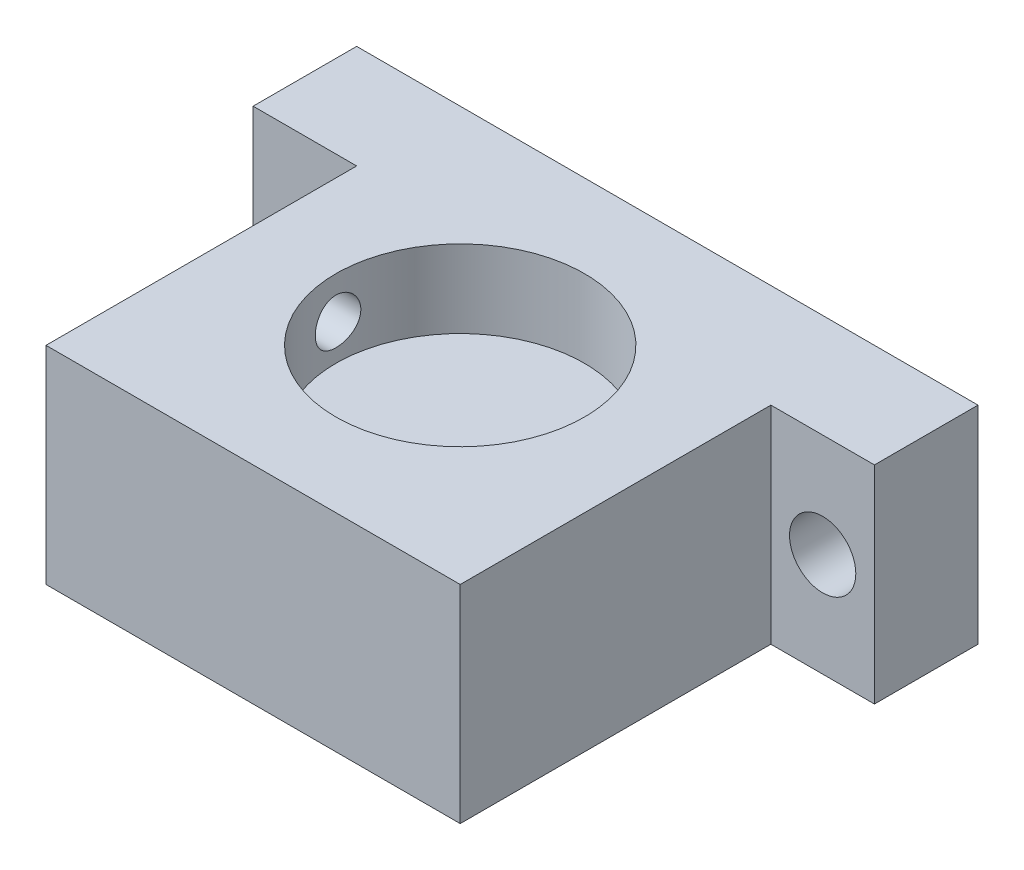
ISO-10303-21;
HEADER;
FILE_DESCRIPTION(('STEP AP214'),'2;1');
FILE_NAME('part.step','',(''),(''),'','','');
FILE_SCHEMA(('AUTOMOTIVE_DESIGN { 1 0 10303 214 1 1 1 1 }'));
ENDSEC;
DATA;
#1=APPLICATION_CONTEXT('core data for automotive mechanical design processes');
#2=APPLICATION_PROTOCOL_DEFINITION('international standard','automotive_design',2000,#1);
#3=PRODUCT_CONTEXT('',#1,'mechanical');
#4=PRODUCT('Part','Part','',(#3));
#5=PRODUCT_RELATED_PRODUCT_CATEGORY('part','',(#4));
#6=PRODUCT_DEFINITION_FORMATION('','',#4);
#7=PRODUCT_DEFINITION_CONTEXT('part definition',#1,'design');
#8=PRODUCT_DEFINITION('design','',#6,#7);
#9=PRODUCT_DEFINITION_SHAPE('','',#8);
#10=(LENGTH_UNIT() NAMED_UNIT(*) SI_UNIT(.MILLI.,.METRE.));
#11=(NAMED_UNIT(*) PLANE_ANGLE_UNIT() SI_UNIT($,.RADIAN.));
#12=(NAMED_UNIT(*) SI_UNIT($,.STERADIAN.) SOLID_ANGLE_UNIT());
#13=UNCERTAINTY_MEASURE_WITH_UNIT(LENGTH_MEASURE(1.E-05),#10,'distance_accuracy_value','');
#14=(GEOMETRIC_REPRESENTATION_CONTEXT(3) GLOBAL_UNCERTAINTY_ASSIGNED_CONTEXT((#13)) GLOBAL_UNIT_ASSIGNED_CONTEXT((#10,
#11,#12)) REPRESENTATION_CONTEXT('',''));
#15=CARTESIAN_POINT('',(0.,0.,0.));
#16=DIRECTION('',(0.,0.,1.));
#17=DIRECTION('',(1.,0.,0.));
#18=AXIS2_PLACEMENT_3D('',#15,#16,#17);
#19=CARTESIAN_POINT('',(0.,10.,0.));
#20=DIRECTION('',(-1.,0.,0.));
#21=DIRECTION('',(0.,0.,1.));
#22=AXIS2_PLACEMENT_3D('',#19,#20,#21);
#23=PLANE('',#22);
#24=CARTESIAN_POINT('',(0.,8.,-10.));
#25=DIRECTION('',(-1.,0.,0.));
#26=DIRECTION('',(0.,0.,1.));
#27=AXIS2_PLACEMENT_3D('',#24,#25,#26);
#28=CIRCLE('',#27,1.1);
#29=CARTESIAN_POINT('',(0.,8.,-8.9));
#30=VERTEX_POINT('',#29);
#31=EDGE_CURVE('E191',#30,#30,#28,.T.);
#32=ORIENTED_EDGE('',*,*,#31,.F.);
#33=EDGE_LOOP('',(#32));
#34=FACE_BOUND('',#33,.T.);
#35=DIRECTION('',(0.,0.,-1.));
#36=VECTOR('',#35,1.);
#37=CARTESIAN_POINT('',(0.,10.,0.));
#38=LINE('',#37,#36);
#39=CARTESIAN_POINT('',(0.,10.,0.));
#40=VERTEX_POINT('',#39);
#41=CARTESIAN_POINT('',(0.,10.,-15.));
#42=VERTEX_POINT('',#41);
#43=EDGE_CURVE('E266',#40,#42,#38,.T.);
#44=ORIENTED_EDGE('',*,*,#43,.T.);
#45=DIRECTION('',(0.,-1.,0.));
#46=VECTOR('',#45,1.);
#47=CARTESIAN_POINT('',(0.,10.,-15.));
#48=LINE('',#47,#46);
#49=CARTESIAN_POINT('',(0.,0.,-15.));
#50=VERTEX_POINT('',#49);
#51=EDGE_CURVE('E131',#42,#50,#48,.T.);
#52=ORIENTED_EDGE('',*,*,#51,.T.);
#53=DIRECTION('',(0.,0.,-1.));
#54=VECTOR('',#53,1.);
#55=CARTESIAN_POINT('',(0.,0.,0.));
#56=LINE('',#55,#54);
#57=CARTESIAN_POINT('',(0.,0.,0.));
#58=VERTEX_POINT('',#57);
#59=EDGE_CURVE('E120',#58,#50,#56,.T.);
#60=ORIENTED_EDGE('',*,*,#59,.F.);
#61=DIRECTION('',(0.,-1.,0.));
#62=VECTOR('',#61,1.);
#63=CARTESIAN_POINT('',(0.,10.,0.));
#64=LINE('',#63,#62);
#65=EDGE_CURVE('E50',#40,#58,#64,.T.);
#66=ORIENTED_EDGE('',*,*,#65,.F.);
#67=EDGE_LOOP('',(#44,#52,#60,#66));
#68=FACE_BOUND('',#67,.T.);
#69=ADVANCED_FACE('F41',(#34,#68),#23,.T.);
#70=CARTESIAN_POINT('',(20.,10.,0.));
#71=DIRECTION('',(-1.,0.,0.));
#72=DIRECTION('',(0.,0.,1.));
#73=AXIS2_PLACEMENT_3D('',#70,#71,#72);
#74=PLANE('',#73);
#75=DIRECTION('',(0.,-1.,0.));
#76=VECTOR('',#75,1.);
#77=CARTESIAN_POINT('',(20.,10.,-15.));
#78=LINE('',#77,#76);
#79=CARTESIAN_POINT('',(20.,10.,-15.));
#80=VERTEX_POINT('',#79);
#81=CARTESIAN_POINT('',(20.,0.,-15.));
#82=VERTEX_POINT('',#81);
#83=EDGE_CURVE('E65',#80,#82,#78,.T.);
#84=ORIENTED_EDGE('',*,*,#83,.F.);
#85=DIRECTION('',(0.,0.,-1.));
#86=VECTOR('',#85,1.);
#87=CARTESIAN_POINT('',(20.,10.,0.));
#88=LINE('',#87,#86);
#89=CARTESIAN_POINT('',(20.,10.,0.));
#90=VERTEX_POINT('',#89);
#91=EDGE_CURVE('E256',#90,#80,#88,.T.);
#92=ORIENTED_EDGE('',*,*,#91,.F.);
#93=DIRECTION('',(0.,-1.,0.));
#94=VECTOR('',#93,1.);
#95=CARTESIAN_POINT('',(20.,10.,0.));
#96=LINE('',#95,#94);
#97=CARTESIAN_POINT('',(20.,0.,0.));
#98=VERTEX_POINT('',#97);
#99=EDGE_CURVE('E11',#90,#98,#96,.T.);
#100=ORIENTED_EDGE('',*,*,#99,.T.);
#101=DIRECTION('',(0.,0.,-1.));
#102=VECTOR('',#101,1.);
#103=CARTESIAN_POINT('',(20.,0.,0.));
#104=LINE('',#103,#102);
#105=EDGE_CURVE('E121',#98,#82,#104,.T.);
#106=ORIENTED_EDGE('',*,*,#105,.T.);
#107=EDGE_LOOP('',(#84,#92,#100,#106));
#108=FACE_BOUND('',#107,.T.);
#109=ADVANCED_FACE('F224',(#108),#74,.F.);
#110=CARTESIAN_POINT('',(0.,10.,0.));
#111=DIRECTION('',(0.,0.,-1.));
#112=DIRECTION('',(-1.,0.,0.));
#113=AXIS2_PLACEMENT_3D('',#110,#111,#112);
#114=PLANE('',#113);
#115=DIRECTION('',(1.,0.,0.));
#116=VECTOR('',#115,1.);
#117=CARTESIAN_POINT('',(0.,0.,0.));
#118=LINE('',#117,#116);
#119=EDGE_CURVE('E274',#58,#98,#118,.T.);
#120=ORIENTED_EDGE('',*,*,#119,.T.);
#121=ORIENTED_EDGE('',*,*,#99,.F.);
#122=DIRECTION('',(1.,0.,0.));
#123=VECTOR('',#122,1.);
#124=CARTESIAN_POINT('',(0.,10.,0.));
#125=LINE('',#124,#123);
#126=EDGE_CURVE('E259',#40,#90,#125,.T.);
#127=ORIENTED_EDGE('',*,*,#126,.F.);
#128=ORIENTED_EDGE('',*,*,#65,.T.);
#129=EDGE_LOOP('',(#120,#121,#127,#128));
#130=FACE_BOUND('',#129,.T.);
#131=ADVANCED_FACE('F43',(#130),#114,.F.);
#132=CARTESIAN_POINT('',(0.,10.,-20.));
#133=DIRECTION('',(0.,0.,-1.));
#134=DIRECTION('',(-1.,0.,0.));
#135=AXIS2_PLACEMENT_3D('',#132,#133,#134);
#136=PLANE('',#135);
#137=CARTESIAN_POINT('',(-2.5,5.,-20.));
#138=DIRECTION('',(0.,0.,-1.));
#139=DIRECTION('',(-1.,0.,0.));
#140=AXIS2_PLACEMENT_3D('',#137,#138,#139);
#141=CIRCLE('',#140,1.6);
#142=CARTESIAN_POINT('',(-4.1,5.,-20.));
#143=VERTEX_POINT('',#142);
#144=EDGE_CURVE('E148',#143,#143,#141,.T.);
#145=ORIENTED_EDGE('',*,*,#144,.F.);
#146=EDGE_LOOP('',(#145));
#147=FACE_BOUND('',#146,.T.);
#148=CARTESIAN_POINT('',(22.5,5.,-20.));
#149=DIRECTION('',(0.,0.,1.));
#150=DIRECTION('',(1.,0.,0.));
#151=AXIS2_PLACEMENT_3D('',#148,#149,#150);
#152=CIRCLE('',#151,1.6);
#153=CARTESIAN_POINT('',(24.1,5.,-20.));
#154=VERTEX_POINT('',#153);
#155=EDGE_CURVE('E154',#154,#154,#152,.T.);
#156=ORIENTED_EDGE('',*,*,#155,.T.);
#157=EDGE_LOOP('',(#156));
#158=FACE_BOUND('',#157,.T.);
#159=DIRECTION('',(1.,0.,0.));
#160=VECTOR('',#159,1.);
#161=CARTESIAN_POINT('',(0.,0.,-20.));
#162=LINE('',#161,#160);
#163=CARTESIAN_POINT('',(-5.,0.,-20.));
#164=VERTEX_POINT('',#163);
#165=CARTESIAN_POINT('',(25.,0.,-20.));
#166=VERTEX_POINT('',#165);
#167=EDGE_CURVE('E108',#164,#166,#162,.T.);
#168=ORIENTED_EDGE('',*,*,#167,.F.);
#169=DIRECTION('',(0.,1.,0.));
#170=VECTOR('',#169,1.);
#171=CARTESIAN_POINT('',(-5.,10.,-20.));
#172=LINE('',#171,#170);
#173=CARTESIAN_POINT('',(-5.,10.,-20.));
#174=VERTEX_POINT('',#173);
#175=EDGE_CURVE('E111',#164,#174,#172,.T.);
#176=ORIENTED_EDGE('',*,*,#175,.T.);
#177=DIRECTION('',(1.,0.,0.));
#178=VECTOR('',#177,1.);
#179=CARTESIAN_POINT('',(0.,10.,-20.));
#180=LINE('',#179,#178);
#181=CARTESIAN_POINT('',(25.,10.,-20.));
#182=VERTEX_POINT('',#181);
#183=EDGE_CURVE('E262',#174,#182,#180,.T.);
#184=ORIENTED_EDGE('',*,*,#183,.T.);
#185=DIRECTION('',(0.,1.,0.));
#186=VECTOR('',#185,1.);
#187=CARTESIAN_POINT('',(25.,10.,-20.));
#188=LINE('',#187,#186);
#189=EDGE_CURVE('E114',#166,#182,#188,.T.);
#190=ORIENTED_EDGE('',*,*,#189,.F.);
#191=EDGE_LOOP('',(#168,#176,#184,#190));
#192=FACE_BOUND('',#191,.T.);
#193=ADVANCED_FACE('F110',(#147,#158,#192),#136,.T.);
#194=CARTESIAN_POINT('',(0.,10.,0.));
#195=DIRECTION('',(0.,1.,0.));
#196=DIRECTION('',(0.,0.,1.));
#197=AXIS2_PLACEMENT_3D('',#194,#195,#196);
#198=PLANE('',#197);
#199=CARTESIAN_POINT('',(10.,10.,-10.));
#200=DIRECTION('',(0.,1.,0.));
#201=DIRECTION('',(0.,0.,1.));
#202=AXIS2_PLACEMENT_3D('',#199,#200,#201);
#203=CIRCLE('',#202,6.);
#204=CARTESIAN_POINT('',(10.,10.,-4.));
#205=VERTEX_POINT('',#204);
#206=EDGE_CURVE('E287',#205,#205,#203,.T.);
#207=ORIENTED_EDGE('',*,*,#206,.F.);
#208=EDGE_LOOP('',(#207));
#209=FACE_BOUND('',#208,.T.);
#210=ORIENTED_EDGE('',*,*,#126,.T.);
#211=ORIENTED_EDGE('',*,*,#91,.T.);
#212=DIRECTION('',(-1.,0.,0.));
#213=VECTOR('',#212,1.);
#214=CARTESIAN_POINT('',(25.,10.,-15.));
#215=LINE('',#214,#213);
#216=CARTESIAN_POINT('',(25.,10.,-15.));
#217=VERTEX_POINT('',#216);
#218=EDGE_CURVE('E178',#217,#80,#215,.T.);
#219=ORIENTED_EDGE('',*,*,#218,.F.);
#220=DIRECTION('',(0.,0.,1.));
#221=VECTOR('',#220,1.);
#222=CARTESIAN_POINT('',(25.,10.,-20.));
#223=LINE('',#222,#221);
#224=EDGE_CURVE('E163',#182,#217,#223,.T.);
#225=ORIENTED_EDGE('',*,*,#224,.F.);
#226=ORIENTED_EDGE('',*,*,#183,.F.);
#227=DIRECTION('',(0.,0.,1.));
#228=VECTOR('',#227,1.);
#229=CARTESIAN_POINT('',(-5.,10.,-20.));
#230=LINE('',#229,#228);
#231=CARTESIAN_POINT('',(-5.,10.,-15.));
#232=VERTEX_POINT('',#231);
#233=EDGE_CURVE('E129',#174,#232,#230,.T.);
#234=ORIENTED_EDGE('',*,*,#233,.T.);
#235=DIRECTION('',(1.,0.,0.));
#236=VECTOR('',#235,1.);
#237=CARTESIAN_POINT('',(-5.,10.,-15.));
#238=LINE('',#237,#236);
#239=EDGE_CURVE('E145',#232,#42,#238,.T.);
#240=ORIENTED_EDGE('',*,*,#239,.T.);
#241=ORIENTED_EDGE('',*,*,#43,.F.);
#242=EDGE_LOOP('',(#210,#211,#219,#225,#226,#234,#240,#241));
#243=FACE_BOUND('',#242,.T.);
#244=ADVANCED_FACE('F236',(#209,#243),#198,.T.);
#245=CARTESIAN_POINT('',(0.,0.,0.));
#246=DIRECTION('',(0.,1.,0.));
#247=DIRECTION('',(0.,0.,1.));
#248=AXIS2_PLACEMENT_3D('',#245,#246,#247);
#249=PLANE('',#248);
#250=ORIENTED_EDGE('',*,*,#119,.F.);
#251=ORIENTED_EDGE('',*,*,#59,.T.);
#252=DIRECTION('',(1.,0.,0.));
#253=VECTOR('',#252,1.);
#254=CARTESIAN_POINT('',(-5.,0.,-15.));
#255=LINE('',#254,#253);
#256=CARTESIAN_POINT('',(-5.,0.,-15.));
#257=VERTEX_POINT('',#256);
#258=EDGE_CURVE('E57',#257,#50,#255,.T.);
#259=ORIENTED_EDGE('',*,*,#258,.F.);
#260=DIRECTION('',(0.,0.,-1.));
#261=VECTOR('',#260,1.);
#262=CARTESIAN_POINT('',(-5.,0.,-20.));
#263=LINE('',#262,#261);
#264=EDGE_CURVE('E127',#257,#164,#263,.T.);
#265=ORIENTED_EDGE('',*,*,#264,.T.);
#266=ORIENTED_EDGE('',*,*,#167,.T.);
#267=DIRECTION('',(0.,0.,-1.));
#268=VECTOR('',#267,1.);
#269=CARTESIAN_POINT('',(25.,0.,-20.));
#270=LINE('',#269,#268);
#271=CARTESIAN_POINT('',(25.,0.,-15.));
#272=VERTEX_POINT('',#271);
#273=EDGE_CURVE('E169',#272,#166,#270,.T.);
#274=ORIENTED_EDGE('',*,*,#273,.F.);
#275=DIRECTION('',(-1.,0.,0.));
#276=VECTOR('',#275,1.);
#277=CARTESIAN_POINT('',(25.,0.,-15.));
#278=LINE('',#277,#276);
#279=EDGE_CURVE('E172',#272,#82,#278,.T.);
#280=ORIENTED_EDGE('',*,*,#279,.T.);
#281=ORIENTED_EDGE('',*,*,#105,.F.);
#282=EDGE_LOOP('',(#250,#251,#259,#265,#266,#274,#280,#281));
#283=FACE_BOUND('',#282,.T.);
#284=ADVANCED_FACE('F134',(#283),#249,.F.);
#285=CARTESIAN_POINT('',(10.,6.25,-10.));
#286=DIRECTION('',(0.,1.,0.));
#287=DIRECTION('',(0.,0.,1.));
#288=AXIS2_PLACEMENT_3D('',#285,#286,#287);
#289=CYLINDRICAL_SURFACE('',#288,6.);
#290=CARTESIAN_POINT('',(4.10169515877655,8.,-8.9));
#291=CARTESIAN_POINT('',(4.10169398720266,7.93877218880364,-8.90000237371739));
#292=CARTESIAN_POINT('',(4.1007314392899,7.87751328478317,-8.90512939894779));
#293=CARTESIAN_POINT('',(4.09698977441668,7.75672104250652,-8.92548924189857));
#294=CARTESIAN_POINT('',(4.09420908845933,7.69718924107027,-8.94073078830776));
#295=CARTESIAN_POINT('',(4.08715642458544,7.58161651620391,-8.98083738244203));
#296=CARTESIAN_POINT('',(4.08288580623358,7.52557246495194,-9.00569365895769));
#297=CARTESIAN_POINT('',(4.07333607779264,7.41845402255767,-9.06430117504623));
#298=CARTESIAN_POINT('',(4.06805705363136,7.36737920853833,-9.09805165682314));
#299=CARTESIAN_POINT('',(4.05701513479813,7.27103683558045,-9.17391780284316));
#300=CARTESIAN_POINT('',(4.05124768041804,7.2258370143823,-9.21611883625319));
#301=CARTESIAN_POINT('',(4.03991906759875,7.1431174859085,-9.30750364498116));
#302=CARTESIAN_POINT('',(4.03435792243844,7.10559827228768,-9.35668786878507));
#303=CARTESIAN_POINT('',(4.02401978892987,7.03904650704907,-9.46108660386093));
#304=CARTESIAN_POINT('',(4.01924879704421,7.01007765442195,-9.51634236636171));
#305=CARTESIAN_POINT('',(4.01107950958681,6.96185912031477,-9.63103840182311));
#306=CARTESIAN_POINT('',(4.00768110612578,6.94260867491088,-9.69047834546389));
#307=CARTESIAN_POINT('',(4.00267210636821,6.91458240250692,-9.81115391714168));
#308=CARTESIAN_POINT('',(4.00104204613375,6.90569245615052,-9.87236222032968));
#309=CARTESIAN_POINT('',(3.99968635339744,6.89828410552863,-9.99542182584629));
#310=CARTESIAN_POINT('',(3.99996056555878,6.89976485529658,-10.057273075317));
#311=CARTESIAN_POINT('',(4.00236726972894,6.91296803381929,-10.1790807174205));
#312=CARTESIAN_POINT('',(4.00447746804131,6.92456759800963,-10.2390509317827));
#313=CARTESIAN_POINT('',(4.01029407262385,6.95748499426706,-10.3561790894273));
#314=CARTESIAN_POINT('',(4.0140005351551,6.97880316887269,-10.4133369335072));
#315=CARTESIAN_POINT('',(4.02263062189491,7.03067075507553,-10.5235761106731));
#316=CARTESIAN_POINT('',(4.02756073719253,7.06126959632459,-10.5766336581858));
#317=CARTESIAN_POINT('',(4.03809237390211,7.13079355105482,-10.6769070619691));
#318=CARTESIAN_POINT('',(4.04369396067622,7.16971947539791,-10.7241223486337));
#319=CARTESIAN_POINT('',(4.05504451050841,7.25547061967889,-10.8120985181677));
#320=CARTESIAN_POINT('',(4.06079443014984,7.30240331134105,-10.8527545929225));
#321=CARTESIAN_POINT('',(4.07171487847998,7.40247688444586,-10.9256336359902));
#322=CARTESIAN_POINT('',(4.07688539941011,7.45561784900223,-10.957856491384));
#323=CARTESIAN_POINT('',(4.08606284114999,7.5667347967941,-11.0129823296607));
#324=CARTESIAN_POINT('',(4.09006792595994,7.62471822578828,-11.0358706296416));
#325=CARTESIAN_POINT('',(4.09643248429562,7.74379737279543,-11.0715513620286));
#326=CARTESIAN_POINT('',(4.09879213546628,7.80489275407014,-11.0843448843106));
#327=CARTESIAN_POINT('',(4.10156366581846,7.92751796538201,-11.099321018336));
#328=CARTESIAN_POINT('',(4.10200313802896,7.98902883043669,-11.1016539618126));
#329=CARTESIAN_POINT('',(4.10095831847082,8.11156135751484,-11.0960452018851));
#330=CARTESIAN_POINT('',(4.09947411743731,8.17258304247518,-11.0881039830891));
#331=CARTESIAN_POINT('',(4.09477484258975,8.29191430574691,-11.0623011960232));
#332=CARTESIAN_POINT('',(4.0915734415042,8.35024140770335,-11.044517957021));
#333=CARTESIAN_POINT('',(4.08381219848301,8.46308802055348,-10.9996188390931));
#334=CARTESIAN_POINT('',(4.07925226028768,8.51760726130164,-10.9725022988315));
#335=CARTESIAN_POINT('',(4.06922462956349,8.62195425189641,-10.9093584848279));
#336=CARTESIAN_POINT('',(4.06374745334566,8.67172343233534,-10.8732359577114));
#337=CARTESIAN_POINT('',(4.05252938046061,8.76454823063037,-10.7932344771494));
#338=CARTESIAN_POINT('',(4.04678846120082,8.80760327195155,-10.7493548583015));
#339=CARTESIAN_POINT('',(4.0356013781273,8.88633659816005,-10.6544144642596));
#340=CARTESIAN_POINT('',(4.0301598992611,8.92191395404711,-10.6032693510626));
#341=CARTESIAN_POINT('',(4.0202628387093,8.98397081156954,-10.4956406817553));
#342=CARTESIAN_POINT('',(4.01580722025911,9.01045065248882,-10.4391573248303));
#343=CARTESIAN_POINT('',(4.00840410044452,9.05340846964247,-10.3227387492708));
#344=CARTESIAN_POINT('',(4.00544903555913,9.06993668690157,-10.2628225712612));
#345=CARTESIAN_POINT('',(4.00134777212,9.09268274601143,-10.1410055958578));
#346=CARTESIAN_POINT('',(4.00020139196836,9.09890162295707,-10.0791049983431));
#347=CARTESIAN_POINT('',(3.99985005667849,9.10081773439716,-9.95604550342522));
#348=CARTESIAN_POINT('',(4.00061693141368,9.09666763690367,-9.8948890109412));
#349=CARTESIAN_POINT('',(4.0039476188779,9.07829710487677,-9.77416027971674));
#350=CARTESIAN_POINT('',(4.00651141598436,9.06407675789477,-9.71458802720749));
#351=CARTESIAN_POINT('',(4.01314814923408,9.02603255561244,-9.59879485560665));
#352=CARTESIAN_POINT('',(4.01721863716066,9.00222427422239,-9.54256867060044));
#353=CARTESIAN_POINT('',(4.02642734730096,8.94569804027037,-9.43488614370467));
#354=CARTESIAN_POINT('',(4.03156563679919,8.91297952621472,-9.38343010268797));
#355=CARTESIAN_POINT('',(4.04243138995553,8.83903276532126,-9.28598595581571));
#356=CARTESIAN_POINT('',(4.04816597155863,8.79769389497519,-9.24008258211476));
#357=CARTESIAN_POINT('',(4.05953217849675,8.7079100662286,-9.15581121438346));
#358=CARTESIAN_POINT('',(4.06516377933692,8.65946344129133,-9.11744499251762));
#359=CARTESIAN_POINT('',(4.07574031169694,8.55633091967783,-9.04902170331487));
#360=CARTESIAN_POINT('',(4.08067877810642,8.50159396299481,-9.01904057107409));
#361=CARTESIAN_POINT('',(4.08923243096181,8.38778829111567,-8.96874691104237));
#362=CARTESIAN_POINT('',(4.0928488810872,8.32872377770077,-8.94842514451586));
#363=CARTESIAN_POINT('',(4.09758482936205,8.22456057229378,-8.92221692906724));
#364=CARTESIAN_POINT('',(4.09911717344114,8.18007637461338,-8.91389966483486));
#365=CARTESIAN_POINT('',(4.10117275799435,8.09040042322635,-8.9027903933941));
#366=CARTESIAN_POINT('',(4.10169602382981,8.0452086873312,-8.89999824732184));
#367=CARTESIAN_POINT('',(4.10169515877655,8.,-8.9));
#368=B_SPLINE_CURVE_WITH_KNOTS('',3,(#290,#291,#292,#293,#294,#295,#296,#297,#298,#299,#300,
#301,#302,#303,#304,#305,#306,#307,#308,#309,#310,#311,#312,#313,#314,#315,#316,#317,#318,#319,
#320,#321,#322,#323,#324,#325,#326,#327,#328,#329,#330,#331,#332,#333,#334,#335,#336,#337,#338,
#339,#340,#341,#342,#343,#344,#345,#346,#347,#348,#349,#350,#351,#352,#353,#354,#355,#356,#357,
#358,#359,#360,#361,#362,#363,#364,#365,#366,#367),.UNSPECIFIED.,.T.,.F.,(4,2,2,2,2,2,2,2,2,2,2,
2,2,2,2,2,2,2,2,2,2,2,2,2,2,2,2,2,2,2,2,2,2,2,2,2,2,2,4),(0.,0.183518018152942,
0.367194616073963,0.550704045420811,0.734197844616834,0.919648445595551,1.10511096228031,
1.29192216021259,1.47871867140141,1.66343759629713,1.84814145333115,2.03063333577598,
2.21313165075937,2.39661956484991,2.58012535448497,2.76632225789003,2.95252165430567,
3.13901281606018,3.32548384066466,3.50926626912269,3.69304002931255,3.87537180276424,
4.05771649848034,4.24207831389519,4.42645595152715,4.61318171085133,4.79990050564448,
4.98566856456926,5.171417970582,5.35444865102127,5.53747774019928,5.72021072233843,
5.9029552223771,6.08820766971312,6.27350362233176,6.46042695050132,6.64717113361602,
6.78267846383738,6.91818238828292),.UNSPECIFIED.);
#369=CARTESIAN_POINT('',(4.10169515877655,8.,-8.9));
#370=VERTEX_POINT('',#369);
#371=EDGE_CURVE('E182',#370,#370,#368,.T.);
#372=ORIENTED_EDGE('',*,*,#371,.F.);
#373=EDGE_LOOP('',(#372));
#374=FACE_BOUND('',#373,.T.);
#375=CARTESIAN_POINT('',(10.,6.25,-10.));
#376=DIRECTION('',(0.,1.,0.));
#377=DIRECTION('',(0.,0.,1.));
#378=AXIS2_PLACEMENT_3D('',#375,#376,#377);
#379=CIRCLE('',#378,6.);
#380=CARTESIAN_POINT('',(10.,6.25,-4.));
#381=VERTEX_POINT('',#380);
#382=EDGE_CURVE('E278',#381,#381,#379,.T.);
#383=ORIENTED_EDGE('',*,*,#382,.F.);
#384=EDGE_LOOP('',(#383));
#385=FACE_BOUND('',#384,.T.);
#386=ORIENTED_EDGE('',*,*,#206,.T.);
#387=EDGE_LOOP('',(#386));
#388=FACE_BOUND('',#387,.T.);
#389=ADVANCED_FACE('F297',(#374,#385,#388),#289,.F.);
#390=CARTESIAN_POINT('',(10.,6.25,-10.));
#391=DIRECTION('',(0.,1.,0.));
#392=DIRECTION('',(0.,0.,1.));
#393=AXIS2_PLACEMENT_3D('',#390,#391,#392);
#394=PLANE('',#393);
#395=ORIENTED_EDGE('',*,*,#382,.T.);
#396=EDGE_LOOP('',(#395));
#397=FACE_BOUND('',#396,.T.);
#398=ADVANCED_FACE('F294',(#397),#394,.T.);
#399=CARTESIAN_POINT('',(20.001,8.,-10.));
#400=DIRECTION('',(-1.,0.,0.));
#401=DIRECTION('',(0.,0.,1.));
#402=AXIS2_PLACEMENT_3D('',#399,#400,#401);
#403=CYLINDRICAL_SURFACE('',#402,1.1);
#404=ORIENTED_EDGE('',*,*,#31,.T.);
#405=EDGE_LOOP('',(#404));
#406=FACE_BOUND('',#405,.T.);
#407=ORIENTED_EDGE('',*,*,#371,.T.);
#408=EDGE_LOOP('',(#407));
#409=FACE_BOUND('',#408,.T.);
#410=ADVANCED_FACE('F193',(#406,#409),#403,.F.);
#411=CARTESIAN_POINT('',(25.,10.,-15.));
#412=DIRECTION('',(0.,0.,-1.));
#413=DIRECTION('',(0.,1.,0.));
#414=AXIS2_PLACEMENT_3D('',#411,#412,#413);
#415=PLANE('',#414);
#416=CARTESIAN_POINT('',(22.5,5.,-15.));
#417=DIRECTION('',(0.,0.,1.));
#418=DIRECTION('',(1.,0.,0.));
#419=AXIS2_PLACEMENT_3D('',#416,#417,#418);
#420=CIRCLE('',#419,1.6);
#421=CARTESIAN_POINT('',(24.1,5.,-15.));
#422=VERTEX_POINT('',#421);
#423=EDGE_CURVE('E153',#422,#422,#420,.T.);
#424=ORIENTED_EDGE('',*,*,#423,.F.);
#425=EDGE_LOOP('',(#424));
#426=FACE_BOUND('',#425,.T.);
#427=ORIENTED_EDGE('',*,*,#83,.T.);
#428=ORIENTED_EDGE('',*,*,#279,.F.);
#429=DIRECTION('',(0.,-1.,0.));
#430=VECTOR('',#429,1.);
#431=CARTESIAN_POINT('',(25.,10.,-15.));
#432=LINE('',#431,#430);
#433=EDGE_CURVE('E166',#217,#272,#432,.T.);
#434=ORIENTED_EDGE('',*,*,#433,.F.);
#435=ORIENTED_EDGE('',*,*,#218,.T.);
#436=EDGE_LOOP('',(#427,#428,#434,#435));
#437=FACE_BOUND('',#436,.T.);
#438=ADVANCED_FACE('F198',(#426,#437),#415,.F.);
#439=CARTESIAN_POINT('',(25.,0.,0.));
#440=DIRECTION('',(-1.,0.,0.));
#441=DIRECTION('',(0.,0.,1.));
#442=AXIS2_PLACEMENT_3D('',#439,#440,#441);
#443=PLANE('',#442);
#444=ORIENTED_EDGE('',*,*,#189,.T.);
#445=ORIENTED_EDGE('',*,*,#224,.T.);
#446=ORIENTED_EDGE('',*,*,#433,.T.);
#447=ORIENTED_EDGE('',*,*,#273,.T.);
#448=EDGE_LOOP('',(#444,#445,#446,#447));
#449=FACE_BOUND('',#448,.T.);
#450=ADVANCED_FACE('F201',(#449),#443,.F.);
#451=CARTESIAN_POINT('',(22.5,5.,-20.));
#452=DIRECTION('',(0.,0.,1.));
#453=DIRECTION('',(1.,0.,0.));
#454=AXIS2_PLACEMENT_3D('',#451,#452,#453);
#455=CYLINDRICAL_SURFACE('',#454,1.6);
#456=ORIENTED_EDGE('',*,*,#155,.F.);
#457=EDGE_LOOP('',(#456));
#458=FACE_BOUND('',#457,.T.);
#459=ORIENTED_EDGE('',*,*,#423,.T.);
#460=EDGE_LOOP('',(#459));
#461=FACE_BOUND('',#460,.T.);
#462=ADVANCED_FACE('F205',(#458,#461),#455,.F.);
#463=CARTESIAN_POINT('',(-5.,10.,-15.));
#464=DIRECTION('',(0.,0.,1.));
#465=DIRECTION('',(0.,-1.,0.));
#466=AXIS2_PLACEMENT_3D('',#463,#464,#465);
#467=PLANE('',#466);
#468=CARTESIAN_POINT('',(-2.5,5.,-15.));
#469=DIRECTION('',(0.,0.,-1.));
#470=DIRECTION('',(-1.,0.,0.));
#471=AXIS2_PLACEMENT_3D('',#468,#469,#470);
#472=CIRCLE('',#471,1.6);
#473=CARTESIAN_POINT('',(-4.1,5.,-15.));
#474=VERTEX_POINT('',#473);
#475=EDGE_CURVE('E410',#474,#474,#472,.T.);
#476=ORIENTED_EDGE('',*,*,#475,.T.);
#477=EDGE_LOOP('',(#476));
#478=FACE_BOUND('',#477,.T.);
#479=ORIENTED_EDGE('',*,*,#51,.F.);
#480=ORIENTED_EDGE('',*,*,#239,.F.);
#481=DIRECTION('',(0.,-1.,0.));
#482=VECTOR('',#481,1.);
#483=CARTESIAN_POINT('',(-5.,10.,-15.));
#484=LINE('',#483,#482);
#485=EDGE_CURVE('E137',#232,#257,#484,.T.);
#486=ORIENTED_EDGE('',*,*,#485,.T.);
#487=ORIENTED_EDGE('',*,*,#258,.T.);
#488=EDGE_LOOP('',(#479,#480,#486,#487));
#489=FACE_BOUND('',#488,.T.);
#490=ADVANCED_FACE('F209',(#478,#489),#467,.T.);
#491=CARTESIAN_POINT('',(-5.,0.,0.));
#492=DIRECTION('',(1.,0.,0.));
#493=DIRECTION('',(0.,0.,1.));
#494=AXIS2_PLACEMENT_3D('',#491,#492,#493);
#495=PLANE('',#494);
#496=ORIENTED_EDGE('',*,*,#175,.F.);
#497=ORIENTED_EDGE('',*,*,#264,.F.);
#498=ORIENTED_EDGE('',*,*,#485,.F.);
#499=ORIENTED_EDGE('',*,*,#233,.F.);
#500=EDGE_LOOP('',(#496,#497,#498,#499));
#501=FACE_BOUND('',#500,.T.);
#502=ADVANCED_FACE('F125',(#501),#495,.F.);
#503=CARTESIAN_POINT('',(-2.5,5.,-20.));
#504=DIRECTION('',(0.,0.,1.));
#505=DIRECTION('',(1.,0.,0.));
#506=AXIS2_PLACEMENT_3D('',#503,#504,#505);
#507=CYLINDRICAL_SURFACE('',#506,1.6);
#508=ORIENTED_EDGE('',*,*,#144,.T.);
#509=EDGE_LOOP('',(#508));
#510=FACE_BOUND('',#509,.T.);
#511=ORIENTED_EDGE('',*,*,#475,.F.);
#512=EDGE_LOOP('',(#511));
#513=FACE_BOUND('',#512,.T.);
#514=ADVANCED_FACE('F216',(#510,#513),#507,.F.);
#515=CLOSED_SHELL('',(#69,#109,#131,#193,#244,#284,#389,#398,#410,#438,#450,#462,#490,#502,#514));
#516=MANIFOLD_SOLID_BREP('B2',#515);
#517=ADVANCED_BREP_SHAPE_REPRESENTATION('',(#18,#516),#14);
#518=SHAPE_DEFINITION_REPRESENTATION(#9,#517);
ENDSEC;
END-ISO-10303-21;
